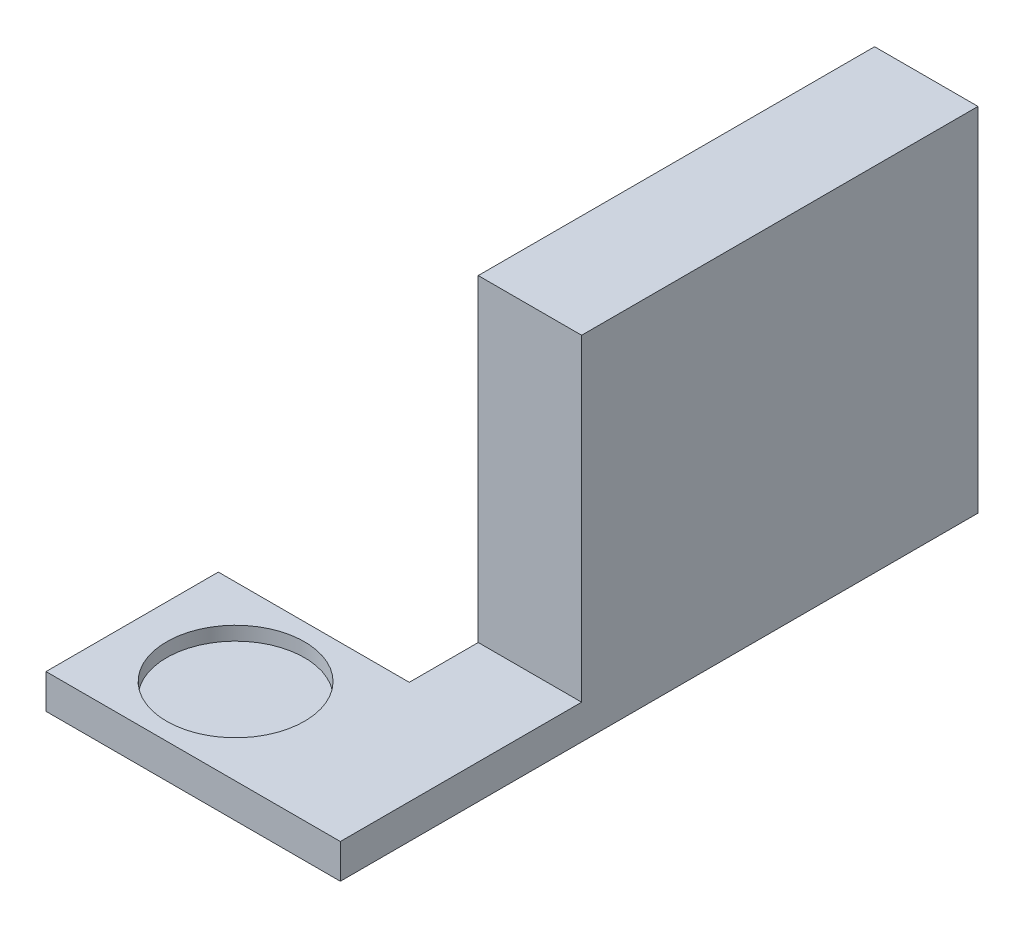
ISO-10303-21;
HEADER;
FILE_DESCRIPTION(('STEP AP214'),'2;1');
FILE_NAME('part.step','',(''),(''),'','','');
FILE_SCHEMA(('AUTOMOTIVE_DESIGN { 1 0 10303 214 1 1 1 1 }'));
ENDSEC;
DATA;
#1=APPLICATION_CONTEXT('core data for automotive mechanical design processes');
#2=APPLICATION_PROTOCOL_DEFINITION('international standard','automotive_design',2000,#1);
#3=PRODUCT_CONTEXT('',#1,'mechanical');
#4=PRODUCT('Part','Part','',(#3));
#5=PRODUCT_RELATED_PRODUCT_CATEGORY('part','',(#4));
#6=PRODUCT_DEFINITION_FORMATION('','',#4);
#7=PRODUCT_DEFINITION_CONTEXT('part definition',#1,'design');
#8=PRODUCT_DEFINITION('design','',#6,#7);
#9=PRODUCT_DEFINITION_SHAPE('','',#8);
#10=(LENGTH_UNIT() NAMED_UNIT(*) SI_UNIT(.MILLI.,.METRE.));
#11=(NAMED_UNIT(*) PLANE_ANGLE_UNIT() SI_UNIT($,.RADIAN.));
#12=(NAMED_UNIT(*) SI_UNIT($,.STERADIAN.) SOLID_ANGLE_UNIT());
#13=UNCERTAINTY_MEASURE_WITH_UNIT(LENGTH_MEASURE(1.E-05),#10,'distance_accuracy_value','');
#14=(GEOMETRIC_REPRESENTATION_CONTEXT(3) GLOBAL_UNCERTAINTY_ASSIGNED_CONTEXT((#13)) GLOBAL_UNIT_ASSIGNED_CONTEXT((#10,
#11,#12)) REPRESENTATION_CONTEXT('',''));
#15=CARTESIAN_POINT('',(0.,0.,0.));
#16=DIRECTION('',(0.,0.,1.));
#17=DIRECTION('',(1.,0.,0.));
#18=AXIS2_PLACEMENT_3D('',#15,#16,#17);
#19=CARTESIAN_POINT('',(0.,15.,0.));
#20=DIRECTION('',(0.,-1.,0.));
#21=DIRECTION('',(0.,0.,-1.));
#22=AXIS2_PLACEMENT_3D('',#19,#20,#21);
#23=PLANE('',#22);
#24=CARTESIAN_POINT('',(40.,15.,0.));
#25=DIRECTION('',(0.,1.,0.));
#26=DIRECTION('',(0.,0.,1.));
#27=AXIS2_PLACEMENT_3D('',#24,#25,#26);
#28=CIRCLE('',#27,10.);
#29=CARTESIAN_POINT('',(40.,15.,10.));
#30=VERTEX_POINT('',#29);
#31=EDGE_CURVE('E133',#30,#30,#28,.T.);
#32=ORIENTED_EDGE('',*,*,#31,.F.);
#33=EDGE_LOOP('',(#32));
#34=FACE_BOUND('',#33,.T.);
#35=DIRECTION('',(1.,0.,0.));
#36=VECTOR('',#35,1.);
#37=CARTESIAN_POINT('',(0.,15.,-22.5));
#38=LINE('',#37,#36);
#39=CARTESIAN_POINT('',(52.7,15.,-22.5));
#40=VERTEX_POINT('',#39);
#41=CARTESIAN_POINT('',(67.7,15.,-22.5));
#42=VERTEX_POINT('',#41);
#43=EDGE_CURVE('E64',#40,#42,#38,.T.);
#44=ORIENTED_EDGE('',*,*,#43,.F.);
#45=DIRECTION('',(0.,0.,-1.));
#46=VECTOR('',#45,1.);
#47=CARTESIAN_POINT('',(52.7,15.,-112.5));
#48=LINE('',#47,#46);
#49=CARTESIAN_POINT('',(52.7,15.,-12.5));
#50=VERTEX_POINT('',#49);
#51=EDGE_CURVE('E12',#50,#40,#48,.T.);
#52=ORIENTED_EDGE('',*,*,#51,.F.);
#53=DIRECTION('',(-1.,0.,0.));
#54=VECTOR('',#53,1.);
#55=CARTESIAN_POINT('',(0.,15.,-12.5));
#56=LINE('',#55,#54);
#57=CARTESIAN_POINT('',(25.,15.,-12.5));
#58=VERTEX_POINT('',#57);
#59=EDGE_CURVE('E166',#50,#58,#56,.T.);
#60=ORIENTED_EDGE('',*,*,#59,.T.);
#61=DIRECTION('',(0.,0.,1.));
#62=VECTOR('',#61,1.);
#63=CARTESIAN_POINT('',(25.,15.,0.));
#64=LINE('',#63,#62);
#65=CARTESIAN_POINT('',(25.,15.,12.5));
#66=VERTEX_POINT('',#65);
#67=EDGE_CURVE('E172',#58,#66,#64,.T.);
#68=ORIENTED_EDGE('',*,*,#67,.T.);
#69=DIRECTION('',(1.,0.,0.));
#70=VECTOR('',#69,1.);
#71=CARTESIAN_POINT('',(0.,15.,12.5));
#72=LINE('',#71,#70);
#73=CARTESIAN_POINT('',(67.7,15.,12.5));
#74=VERTEX_POINT('',#73);
#75=EDGE_CURVE('E174',#66,#74,#72,.T.);
#76=ORIENTED_EDGE('',*,*,#75,.T.);
#77=DIRECTION('',(0.,0.,-1.));
#78=VECTOR('',#77,1.);
#79=CARTESIAN_POINT('',(67.7,15.,0.));
#80=LINE('',#79,#78);
#81=EDGE_CURVE('E147',#74,#42,#80,.T.);
#82=ORIENTED_EDGE('',*,*,#81,.T.);
#83=EDGE_LOOP('',(#44,#52,#60,#68,#76,#82));
#84=FACE_BOUND('',#83,.T.);
#85=ADVANCED_FACE('F45',(#34,#84),#23,.F.);
#86=CARTESIAN_POINT('',(-50.,15.,-12.5));
#87=DIRECTION('',(0.,0.,1.));
#88=DIRECTION('',(1.,0.,0.));
#89=AXIS2_PLACEMENT_3D('',#86,#87,#88);
#90=PLANE('',#89);
#91=DIRECTION('',(0.,1.,0.));
#92=VECTOR('',#91,1.);
#93=CARTESIAN_POINT('',(52.7,5.,-12.5));
#94=LINE('',#93,#92);
#95=CARTESIAN_POINT('',(52.7,10.,-12.5));
#96=VERTEX_POINT('',#95);
#97=EDGE_CURVE('E124',#96,#50,#94,.T.);
#98=ORIENTED_EDGE('',*,*,#97,.F.);
#99=DIRECTION('',(-1.,0.,0.));
#100=VECTOR('',#99,1.);
#101=CARTESIAN_POINT('',(0.,10.,-12.5));
#102=LINE('',#101,#100);
#103=CARTESIAN_POINT('',(25.,10.,-12.5));
#104=VERTEX_POINT('',#103);
#105=EDGE_CURVE('E112',#96,#104,#102,.T.);
#106=ORIENTED_EDGE('',*,*,#105,.T.);
#107=DIRECTION('',(0.,-1.,0.));
#108=VECTOR('',#107,1.);
#109=CARTESIAN_POINT('',(25.,15.,-12.5));
#110=LINE('',#109,#108);
#111=EDGE_CURVE('E55',#58,#104,#110,.T.);
#112=ORIENTED_EDGE('',*,*,#111,.F.);
#113=ORIENTED_EDGE('',*,*,#59,.F.);
#114=EDGE_LOOP('',(#98,#106,#112,#113));
#115=FACE_BOUND('',#114,.T.);
#116=ADVANCED_FACE('F169',(#115),#90,.F.);
#117=CARTESIAN_POINT('',(67.7,15.,20.));
#118=DIRECTION('',(-1.,0.,0.));
#119=DIRECTION('',(0.,0.,1.));
#120=AXIS2_PLACEMENT_3D('',#117,#118,#119);
#121=PLANE('',#120);
#122=DIRECTION('',(0.,0.,-1.));
#123=VECTOR('',#122,1.);
#124=CARTESIAN_POINT('',(67.7,10.,0.));
#125=LINE('',#124,#123);
#126=CARTESIAN_POINT('',(67.7,10.,12.5));
#127=VERTEX_POINT('',#126);
#128=CARTESIAN_POINT('',(67.7,10.,-80.));
#129=VERTEX_POINT('',#128);
#130=EDGE_CURVE('E102',#127,#129,#125,.T.);
#131=ORIENTED_EDGE('',*,*,#130,.T.);
#132=DIRECTION('',(0.,-1.,0.));
#133=VECTOR('',#132,1.);
#134=CARTESIAN_POINT('',(67.7,0.,-80.));
#135=LINE('',#134,#133);
#136=CARTESIAN_POINT('',(67.7,61.1,-80.));
#137=VERTEX_POINT('',#136);
#138=EDGE_CURVE('E105',#137,#129,#135,.T.);
#139=ORIENTED_EDGE('',*,*,#138,.F.);
#140=DIRECTION('',(0.,0.,-1.));
#141=VECTOR('',#140,1.);
#142=CARTESIAN_POINT('',(67.7,61.1,0.));
#143=LINE('',#142,#141);
#144=CARTESIAN_POINT('',(67.7,61.1,-22.5));
#145=VERTEX_POINT('',#144);
#146=EDGE_CURVE('E132',#145,#137,#143,.T.);
#147=ORIENTED_EDGE('',*,*,#146,.F.);
#148=DIRECTION('',(0.,-1.,0.));
#149=VECTOR('',#148,1.);
#150=CARTESIAN_POINT('',(67.7,15.,-22.5));
#151=LINE('',#150,#149);
#152=EDGE_CURVE('E153',#145,#42,#151,.T.);
#153=ORIENTED_EDGE('',*,*,#152,.T.);
#154=ORIENTED_EDGE('',*,*,#81,.F.);
#155=DIRECTION('',(0.,-1.,0.));
#156=VECTOR('',#155,1.);
#157=CARTESIAN_POINT('',(67.7,15.,12.5));
#158=LINE('',#157,#156);
#159=EDGE_CURVE('E109',#74,#127,#158,.T.);
#160=ORIENTED_EDGE('',*,*,#159,.T.);
#161=EDGE_LOOP('',(#131,#139,#147,#153,#154,#160));
#162=FACE_BOUND('',#161,.T.);
#163=ADVANCED_FACE('F103',(#162),#121,.F.);
#164=CARTESIAN_POINT('',(25.,15.,20.));
#165=DIRECTION('',(1.,0.,0.));
#166=DIRECTION('',(0.,0.,-1.));
#167=AXIS2_PLACEMENT_3D('',#164,#165,#166);
#168=PLANE('',#167);
#169=DIRECTION('',(0.,0.,1.));
#170=VECTOR('',#169,1.);
#171=CARTESIAN_POINT('',(25.,10.,0.));
#172=LINE('',#171,#170);
#173=CARTESIAN_POINT('',(25.,10.,12.5));
#174=VERTEX_POINT('',#173);
#175=EDGE_CURVE('E141',#104,#174,#172,.T.);
#176=ORIENTED_EDGE('',*,*,#175,.T.);
#177=DIRECTION('',(0.,-1.,0.));
#178=VECTOR('',#177,1.);
#179=CARTESIAN_POINT('',(25.,15.,12.5));
#180=LINE('',#179,#178);
#181=EDGE_CURVE('E180',#66,#174,#180,.T.);
#182=ORIENTED_EDGE('',*,*,#181,.F.);
#183=ORIENTED_EDGE('',*,*,#67,.F.);
#184=ORIENTED_EDGE('',*,*,#111,.T.);
#185=EDGE_LOOP('',(#176,#182,#183,#184));
#186=FACE_BOUND('',#185,.T.);
#187=ADVANCED_FACE('F191',(#186),#168,.F.);
#188=CARTESIAN_POINT('',(-50.,15.,12.5));
#189=DIRECTION('',(0.,0.,-1.));
#190=DIRECTION('',(-1.,0.,0.));
#191=AXIS2_PLACEMENT_3D('',#188,#189,#190);
#192=PLANE('',#191);
#193=DIRECTION('',(1.,0.,0.));
#194=VECTOR('',#193,1.);
#195=CARTESIAN_POINT('',(0.,10.,12.5));
#196=LINE('',#195,#194);
#197=EDGE_CURVE('E144',#174,#127,#196,.T.);
#198=ORIENTED_EDGE('',*,*,#197,.T.);
#199=ORIENTED_EDGE('',*,*,#159,.F.);
#200=ORIENTED_EDGE('',*,*,#75,.F.);
#201=ORIENTED_EDGE('',*,*,#181,.T.);
#202=EDGE_LOOP('',(#198,#199,#200,#201));
#203=FACE_BOUND('',#202,.T.);
#204=ADVANCED_FACE('F187',(#203),#192,.F.);
#205=CARTESIAN_POINT('',(0.,10.,0.));
#206=DIRECTION('',(0.,-1.,0.));
#207=DIRECTION('',(0.,0.,-1.));
#208=AXIS2_PLACEMENT_3D('',#205,#206,#207);
#209=PLANE('',#208);
#210=ORIENTED_EDGE('',*,*,#130,.F.);
#211=ORIENTED_EDGE('',*,*,#197,.F.);
#212=ORIENTED_EDGE('',*,*,#175,.F.);
#213=ORIENTED_EDGE('',*,*,#105,.F.);
#214=DIRECTION('',(0.,0.,1.));
#215=VECTOR('',#214,1.);
#216=CARTESIAN_POINT('',(52.7,10.,0.));
#217=LINE('',#216,#215);
#218=CARTESIAN_POINT('',(52.7,10.,-80.));
#219=VERTEX_POINT('',#218);
#220=EDGE_CURVE('E118',#219,#96,#217,.T.);
#221=ORIENTED_EDGE('',*,*,#220,.F.);
#222=DIRECTION('',(-1.,0.,0.));
#223=VECTOR('',#222,1.);
#224=CARTESIAN_POINT('',(0.,10.,-80.));
#225=LINE('',#224,#223);
#226=EDGE_CURVE('E49',#129,#219,#225,.T.);
#227=ORIENTED_EDGE('',*,*,#226,.F.);
#228=EDGE_LOOP('',(#210,#211,#212,#213,#221,#227));
#229=FACE_BOUND('',#228,.T.);
#230=ADVANCED_FACE('F115',(#229),#209,.T.);
#231=CARTESIAN_POINT('',(40.,13.,0.));
#232=DIRECTION('',(0.,1.,0.));
#233=DIRECTION('',(0.,0.,1.));
#234=AXIS2_PLACEMENT_3D('',#231,#232,#233);
#235=CYLINDRICAL_SURFACE('',#234,10.);
#236=CARTESIAN_POINT('',(40.,13.,0.));
#237=DIRECTION('',(0.,1.,0.));
#238=DIRECTION('',(0.,0.,1.));
#239=AXIS2_PLACEMENT_3D('',#236,#237,#238);
#240=CIRCLE('',#239,10.);
#241=CARTESIAN_POINT('',(40.,13.,10.));
#242=VERTEX_POINT('',#241);
#243=EDGE_CURVE('E113',#242,#242,#240,.T.);
#244=ORIENTED_EDGE('',*,*,#243,.F.);
#245=EDGE_LOOP('',(#244));
#246=FACE_BOUND('',#245,.T.);
#247=ORIENTED_EDGE('',*,*,#31,.T.);
#248=EDGE_LOOP('',(#247));
#249=FACE_BOUND('',#248,.T.);
#250=ADVANCED_FACE('F213',(#246,#249),#235,.F.);
#251=CARTESIAN_POINT('',(40.,13.,0.));
#252=DIRECTION('',(0.,1.,0.));
#253=DIRECTION('',(0.,0.,1.));
#254=AXIS2_PLACEMENT_3D('',#251,#252,#253);
#255=PLANE('',#254);
#256=ORIENTED_EDGE('',*,*,#243,.T.);
#257=EDGE_LOOP('',(#256));
#258=FACE_BOUND('',#257,.T.);
#259=ADVANCED_FACE('F216',(#258),#255,.T.);
#260=CARTESIAN_POINT('',(52.7,5.,-112.5));
#261=DIRECTION('',(1.,0.,0.));
#262=DIRECTION('',(0.,0.,-1.));
#263=AXIS2_PLACEMENT_3D('',#260,#261,#262);
#264=PLANE('',#263);
#265=ORIENTED_EDGE('',*,*,#97,.T.);
#266=ORIENTED_EDGE('',*,*,#51,.T.);
#267=DIRECTION('',(0.,-1.,0.));
#268=VECTOR('',#267,1.);
#269=CARTESIAN_POINT('',(52.7,62.8,-22.5));
#270=LINE('',#269,#268);
#271=CARTESIAN_POINT('',(52.7,61.1,-22.5));
#272=VERTEX_POINT('',#271);
#273=EDGE_CURVE('E127',#272,#40,#270,.T.);
#274=ORIENTED_EDGE('',*,*,#273,.F.);
#275=DIRECTION('',(0.,0.,1.));
#276=VECTOR('',#275,1.);
#277=CARTESIAN_POINT('',(52.7,61.1,0.));
#278=LINE('',#277,#276);
#279=CARTESIAN_POINT('',(52.7,61.1,-80.));
#280=VERTEX_POINT('',#279);
#281=EDGE_CURVE('E131',#280,#272,#278,.T.);
#282=ORIENTED_EDGE('',*,*,#281,.F.);
#283=DIRECTION('',(0.,1.,0.));
#284=VECTOR('',#283,1.);
#285=CARTESIAN_POINT('',(52.7,0.,-80.));
#286=LINE('',#285,#284);
#287=EDGE_CURVE('E120',#219,#280,#286,.T.);
#288=ORIENTED_EDGE('',*,*,#287,.F.);
#289=ORIENTED_EDGE('',*,*,#220,.T.);
#290=EDGE_LOOP('',(#265,#266,#274,#282,#288,#289));
#291=FACE_BOUND('',#290,.T.);
#292=ADVANCED_FACE('F161',(#291),#264,.F.);
#293=CARTESIAN_POINT('',(0.,0.,-80.));
#294=DIRECTION('',(0.,0.,1.));
#295=DIRECTION('',(1.,0.,0.));
#296=AXIS2_PLACEMENT_3D('',#293,#294,#295);
#297=PLANE('',#296);
#298=ORIENTED_EDGE('',*,*,#138,.T.);
#299=ORIENTED_EDGE('',*,*,#226,.T.);
#300=ORIENTED_EDGE('',*,*,#287,.T.);
#301=DIRECTION('',(-1.,0.,0.));
#302=VECTOR('',#301,1.);
#303=CARTESIAN_POINT('',(0.,61.1,-80.));
#304=LINE('',#303,#302);
#305=EDGE_CURVE('E122',#137,#280,#304,.T.);
#306=ORIENTED_EDGE('',*,*,#305,.F.);
#307=EDGE_LOOP('',(#298,#299,#300,#306));
#308=FACE_BOUND('',#307,.T.);
#309=ADVANCED_FACE('F47',(#308),#297,.F.);
#310=CARTESIAN_POINT('',(67.7,62.8,-22.5));
#311=DIRECTION('',(0.,0.,-1.));
#312=DIRECTION('',(-1.,0.,0.));
#313=AXIS2_PLACEMENT_3D('',#310,#311,#312);
#314=PLANE('',#313);
#315=ORIENTED_EDGE('',*,*,#43,.T.);
#316=ORIENTED_EDGE('',*,*,#152,.F.);
#317=DIRECTION('',(1.,0.,0.));
#318=VECTOR('',#317,1.);
#319=CARTESIAN_POINT('',(0.,61.1,-22.5));
#320=LINE('',#319,#318);
#321=EDGE_CURVE('E150',#272,#145,#320,.T.);
#322=ORIENTED_EDGE('',*,*,#321,.F.);
#323=ORIENTED_EDGE('',*,*,#273,.T.);
#324=EDGE_LOOP('',(#315,#316,#322,#323));
#325=FACE_BOUND('',#324,.T.);
#326=ADVANCED_FACE('F158',(#325),#314,.F.);
#327=CARTESIAN_POINT('',(0.,61.1,0.));
#328=DIRECTION('',(0.,-1.,0.));
#329=DIRECTION('',(0.,0.,-1.));
#330=AXIS2_PLACEMENT_3D('',#327,#328,#329);
#331=PLANE('',#330);
#332=ORIENTED_EDGE('',*,*,#146,.T.);
#333=ORIENTED_EDGE('',*,*,#305,.T.);
#334=ORIENTED_EDGE('',*,*,#281,.T.);
#335=ORIENTED_EDGE('',*,*,#321,.T.);
#336=EDGE_LOOP('',(#332,#333,#334,#335));
#337=FACE_BOUND('',#336,.T.);
#338=ADVANCED_FACE('F230',(#337),#331,.F.);
#339=CLOSED_SHELL('',(#85,#116,#163,#187,#204,#230,#250,#259,#292,#309,#326,#338));
#340=MANIFOLD_SOLID_BREP('B2',#339);
#341=ADVANCED_BREP_SHAPE_REPRESENTATION('',(#18,#340),#14);
#342=SHAPE_DEFINITION_REPRESENTATION(#9,#341);
ENDSEC;
END-ISO-10303-21;
